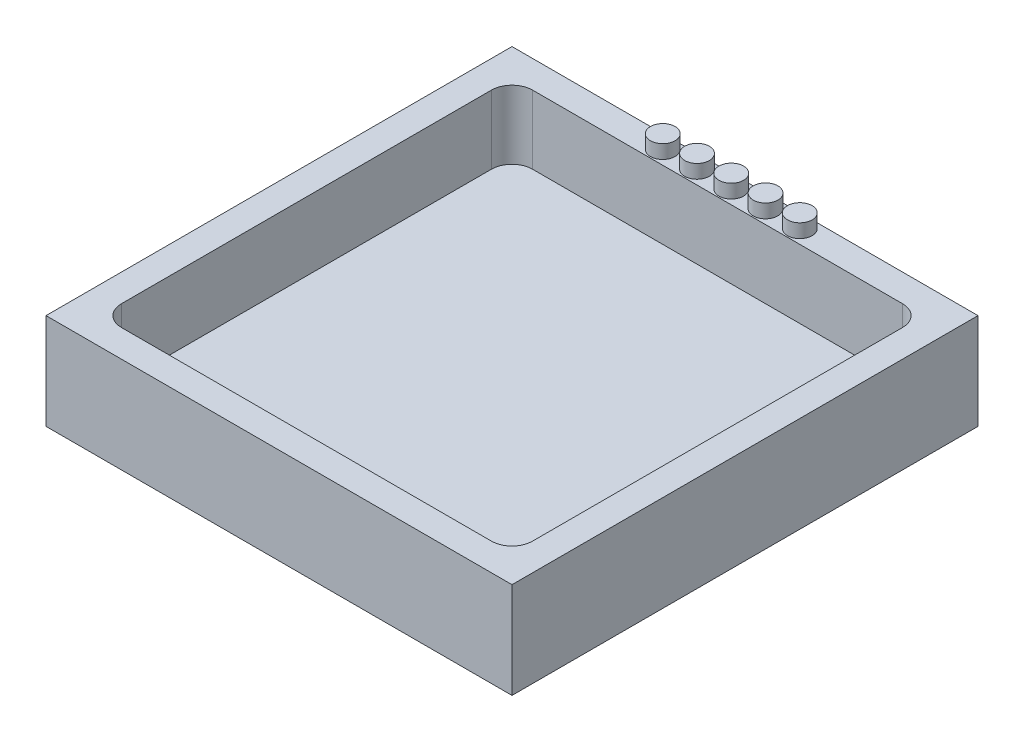
ISO-10303-21;
HEADER;
FILE_DESCRIPTION(('STEP AP214'),'2;1');
FILE_NAME('part.step','',(''),(''),'','','');
FILE_SCHEMA(('AUTOMOTIVE_DESIGN { 1 0 10303 214 1 1 1 1 }'));
ENDSEC;
DATA;
#1=APPLICATION_CONTEXT('core data for automotive mechanical design processes');
#2=APPLICATION_PROTOCOL_DEFINITION('international standard','automotive_design',2000,#1);
#3=PRODUCT_CONTEXT('',#1,'mechanical');
#4=PRODUCT('Part','Part','',(#3));
#5=PRODUCT_RELATED_PRODUCT_CATEGORY('part','',(#4));
#6=PRODUCT_DEFINITION_FORMATION('','',#4);
#7=PRODUCT_DEFINITION_CONTEXT('part definition',#1,'design');
#8=PRODUCT_DEFINITION('design','',#6,#7);
#9=PRODUCT_DEFINITION_SHAPE('','',#8);
#10=(LENGTH_UNIT() NAMED_UNIT(*) SI_UNIT(.MILLI.,.METRE.));
#11=(NAMED_UNIT(*) PLANE_ANGLE_UNIT() SI_UNIT($,.RADIAN.));
#12=(NAMED_UNIT(*) SI_UNIT($,.STERADIAN.) SOLID_ANGLE_UNIT());
#13=UNCERTAINTY_MEASURE_WITH_UNIT(LENGTH_MEASURE(1.E-05),#10,'distance_accuracy_value','');
#14=(GEOMETRIC_REPRESENTATION_CONTEXT(3) GLOBAL_UNCERTAINTY_ASSIGNED_CONTEXT((#13)) GLOBAL_UNIT_ASSIGNED_CONTEXT((#10,
#11,#12)) REPRESENTATION_CONTEXT('',''));
#15=CARTESIAN_POINT('',(0.,0.,0.));
#16=DIRECTION('',(0.,0.,1.));
#17=DIRECTION('',(1.,0.,0.));
#18=AXIS2_PLACEMENT_3D('',#15,#16,#17);
#19=CARTESIAN_POINT('',(0.,2.,0.));
#20=DIRECTION('',(0.,-1.,0.));
#21=DIRECTION('',(0.,0.,-1.));
#22=AXIS2_PLACEMENT_3D('',#19,#20,#21);
#23=PLANE('',#22);
#24=DIRECTION('',(1.,0.,0.));
#25=VECTOR('',#24,1.);
#26=CARTESIAN_POINT('',(-15.,2.,15.));
#27=LINE('',#26,#25);
#28=CARTESIAN_POINT('',(-13.5,2.,15.));
#29=VERTEX_POINT('',#28);
#30=CARTESIAN_POINT('',(13.5,2.,15.));
#31=VERTEX_POINT('',#30);
#32=EDGE_CURVE('E168',#29,#31,#27,.T.);
#33=ORIENTED_EDGE('',*,*,#32,.T.);
#34=CARTESIAN_POINT('',(13.5,2.,13.5));
#35=DIRECTION('',(0.,-1.,0.));
#36=DIRECTION('',(0.,0.,-1.));
#37=AXIS2_PLACEMENT_3D('',#34,#35,#36);
#38=CIRCLE('',#37,1.5);
#39=CARTESIAN_POINT('',(15.,2.,13.5));
#40=VERTEX_POINT('',#39);
#41=EDGE_CURVE('E182',#31,#40,#38,.F.);
#42=ORIENTED_EDGE('',*,*,#41,.T.);
#43=DIRECTION('',(0.,0.,-1.));
#44=VECTOR('',#43,1.);
#45=CARTESIAN_POINT('',(15.,2.,15.));
#46=LINE('',#45,#44);
#47=CARTESIAN_POINT('',(15.,2.,-13.5));
#48=VERTEX_POINT('',#47);
#49=EDGE_CURVE('E165',#40,#48,#46,.T.);
#50=ORIENTED_EDGE('',*,*,#49,.T.);
#51=CARTESIAN_POINT('',(13.5,2.,-13.5));
#52=DIRECTION('',(0.,-1.,0.));
#53=DIRECTION('',(0.,0.,-1.));
#54=AXIS2_PLACEMENT_3D('',#51,#52,#53);
#55=CIRCLE('',#54,1.5);
#56=CARTESIAN_POINT('',(13.5,2.,-15.));
#57=VERTEX_POINT('',#56);
#58=EDGE_CURVE('E176',#48,#57,#55,.F.);
#59=ORIENTED_EDGE('',*,*,#58,.T.);
#60=DIRECTION('',(1.,0.,0.));
#61=VECTOR('',#60,1.);
#62=CARTESIAN_POINT('',(-15.,2.,-15.));
#63=LINE('',#62,#61);
#64=CARTESIAN_POINT('',(-13.5,2.,-15.));
#65=VERTEX_POINT('',#64);
#66=EDGE_CURVE('E157',#65,#57,#63,.T.);
#67=ORIENTED_EDGE('',*,*,#66,.F.);
#68=CARTESIAN_POINT('',(-13.5,2.,-13.5));
#69=DIRECTION('',(0.,-1.,0.));
#70=DIRECTION('',(0.,0.,-1.));
#71=AXIS2_PLACEMENT_3D('',#68,#69,#70);
#72=CIRCLE('',#71,1.5);
#73=CARTESIAN_POINT('',(-15.,2.,-13.5));
#74=VERTEX_POINT('',#73);
#75=EDGE_CURVE('E180',#65,#74,#72,.F.);
#76=ORIENTED_EDGE('',*,*,#75,.T.);
#77=DIRECTION('',(0.,0.,-1.));
#78=VECTOR('',#77,1.);
#79=CARTESIAN_POINT('',(-15.,2.,15.));
#80=LINE('',#79,#78);
#81=CARTESIAN_POINT('',(-15.,2.,13.5));
#82=VERTEX_POINT('',#81);
#83=EDGE_CURVE('E155',#82,#74,#80,.T.);
#84=ORIENTED_EDGE('',*,*,#83,.F.);
#85=CARTESIAN_POINT('',(-13.5,2.,13.5));
#86=DIRECTION('',(0.,-1.,0.));
#87=DIRECTION('',(0.,0.,-1.));
#88=AXIS2_PLACEMENT_3D('',#85,#86,#87);
#89=CIRCLE('',#88,1.5);
#90=EDGE_CURVE('E178',#82,#29,#89,.F.);
#91=ORIENTED_EDGE('',*,*,#90,.T.);
#92=EDGE_LOOP('',(#33,#42,#50,#59,#67,#76,#84,#91));
#93=FACE_BOUND('',#92,.T.);
#94=ADVANCED_FACE('F39',(#93),#23,.F.);
#95=CARTESIAN_POINT('',(15.,7.,15.));
#96=DIRECTION('',(-1.,0.,0.));
#97=DIRECTION('',(0.,0.,1.));
#98=AXIS2_PLACEMENT_3D('',#95,#96,#97);
#99=PLANE('',#98);
#100=ORIENTED_EDGE('',*,*,#49,.F.);
#101=DIRECTION('',(0.,-1.,0.));
#102=VECTOR('',#101,1.);
#103=CARTESIAN_POINT('',(15.,7.,13.5));
#104=LINE('',#103,#102);
#105=CARTESIAN_POINT('',(15.,7.,13.5));
#106=VERTEX_POINT('',#105);
#107=EDGE_CURVE('E187',#40,#106,#104,.F.);
#108=ORIENTED_EDGE('',*,*,#107,.T.);
#109=DIRECTION('',(0.,0.,-1.));
#110=VECTOR('',#109,1.);
#111=CARTESIAN_POINT('',(15.,7.,15.));
#112=LINE('',#111,#110);
#113=CARTESIAN_POINT('',(15.,7.,-13.5));
#114=VERTEX_POINT('',#113);
#115=EDGE_CURVE('E289',#106,#114,#112,.T.);
#116=ORIENTED_EDGE('',*,*,#115,.T.);
#117=DIRECTION('',(0.,-1.,0.));
#118=VECTOR('',#117,1.);
#119=CARTESIAN_POINT('',(15.,2.,-13.5));
#120=LINE('',#119,#118);
#121=EDGE_CURVE('E184',#114,#48,#120,.T.);
#122=ORIENTED_EDGE('',*,*,#121,.T.);
#123=EDGE_LOOP('',(#100,#108,#116,#122));
#124=FACE_BOUND('',#123,.T.);
#125=ADVANCED_FACE('F246',(#124),#99,.T.);
#126=CARTESIAN_POINT('',(-15.,7.,-15.));
#127=DIRECTION('',(0.,0.,1.));
#128=DIRECTION('',(1.,0.,0.));
#129=AXIS2_PLACEMENT_3D('',#126,#127,#128);
#130=PLANE('',#129);
#131=DIRECTION('',(-1.,0.,0.));
#132=VECTOR('',#131,1.);
#133=CARTESIAN_POINT('',(-15.,7.,-15.));
#134=LINE('',#133,#132);
#135=CARTESIAN_POINT('',(13.5,7.,-15.));
#136=VERTEX_POINT('',#135);
#137=CARTESIAN_POINT('',(-13.5,7.,-15.));
#138=VERTEX_POINT('',#137);
#139=EDGE_CURVE('E287',#136,#138,#134,.T.);
#140=ORIENTED_EDGE('',*,*,#139,.T.);
#141=DIRECTION('',(0.,-1.,0.));
#142=VECTOR('',#141,1.);
#143=CARTESIAN_POINT('',(-13.5,2.,-15.));
#144=LINE('',#143,#142);
#145=EDGE_CURVE('E191',#138,#65,#144,.T.);
#146=ORIENTED_EDGE('',*,*,#145,.T.);
#147=ORIENTED_EDGE('',*,*,#66,.T.);
#148=DIRECTION('',(0.,-1.,0.));
#149=VECTOR('',#148,1.);
#150=CARTESIAN_POINT('',(13.5,7.,-15.));
#151=LINE('',#150,#149);
#152=EDGE_CURVE('E189',#57,#136,#151,.F.);
#153=ORIENTED_EDGE('',*,*,#152,.T.);
#154=EDGE_LOOP('',(#140,#146,#147,#153));
#155=FACE_BOUND('',#154,.T.);
#156=ADVANCED_FACE('F253',(#155),#130,.T.);
#157=CARTESIAN_POINT('',(-15.,7.,15.));
#158=DIRECTION('',(1.,0.,0.));
#159=DIRECTION('',(0.,0.,-1.));
#160=AXIS2_PLACEMENT_3D('',#157,#158,#159);
#161=PLANE('',#160);
#162=ORIENTED_EDGE('',*,*,#83,.T.);
#163=DIRECTION('',(0.,-1.,0.));
#164=VECTOR('',#163,1.);
#165=CARTESIAN_POINT('',(-15.,7.,-13.5));
#166=LINE('',#165,#164);
#167=CARTESIAN_POINT('',(-15.,7.,-13.5));
#168=VERTEX_POINT('',#167);
#169=EDGE_CURVE('E61',#74,#168,#166,.F.);
#170=ORIENTED_EDGE('',*,*,#169,.T.);
#171=DIRECTION('',(0.,0.,1.));
#172=VECTOR('',#171,1.);
#173=CARTESIAN_POINT('',(-15.,7.,15.));
#174=LINE('',#173,#172);
#175=CARTESIAN_POINT('',(-15.,7.,13.5));
#176=VERTEX_POINT('',#175);
#177=EDGE_CURVE('E278',#168,#176,#174,.T.);
#178=ORIENTED_EDGE('',*,*,#177,.T.);
#179=DIRECTION('',(0.,-1.,0.));
#180=VECTOR('',#179,1.);
#181=CARTESIAN_POINT('',(-15.,2.,13.5));
#182=LINE('',#181,#180);
#183=EDGE_CURVE('E194',#176,#82,#182,.T.);
#184=ORIENTED_EDGE('',*,*,#183,.T.);
#185=EDGE_LOOP('',(#162,#170,#178,#184));
#186=FACE_BOUND('',#185,.T.);
#187=ADVANCED_FACE('F277',(#186),#161,.T.);
#188=CARTESIAN_POINT('',(-15.,7.,15.));
#189=DIRECTION('',(0.,0.,-1.));
#190=DIRECTION('',(-1.,0.,0.));
#191=AXIS2_PLACEMENT_3D('',#188,#189,#190);
#192=PLANE('',#191);
#193=DIRECTION('',(1.,0.,0.));
#194=VECTOR('',#193,1.);
#195=CARTESIAN_POINT('',(-15.,7.,15.));
#196=LINE('',#195,#194);
#197=CARTESIAN_POINT('',(-13.5,7.,15.));
#198=VERTEX_POINT('',#197);
#199=CARTESIAN_POINT('',(13.5,7.,15.));
#200=VERTEX_POINT('',#199);
#201=EDGE_CURVE('E291',#198,#200,#196,.T.);
#202=ORIENTED_EDGE('',*,*,#201,.T.);
#203=DIRECTION('',(0.,-1.,0.));
#204=VECTOR('',#203,1.);
#205=CARTESIAN_POINT('',(13.5,2.,15.));
#206=LINE('',#205,#204);
#207=EDGE_CURVE('E173',#200,#31,#206,.T.);
#208=ORIENTED_EDGE('',*,*,#207,.T.);
#209=ORIENTED_EDGE('',*,*,#32,.F.);
#210=DIRECTION('',(0.,-1.,0.));
#211=VECTOR('',#210,1.);
#212=CARTESIAN_POINT('',(-13.5,7.,15.));
#213=LINE('',#212,#211);
#214=EDGE_CURVE('E171',#29,#198,#213,.F.);
#215=ORIENTED_EDGE('',*,*,#214,.T.);
#216=EDGE_LOOP('',(#202,#208,#209,#215));
#217=FACE_BOUND('',#216,.T.);
#218=ADVANCED_FACE('F220',(#217),#192,.T.);
#219=CARTESIAN_POINT('',(0.,7.,0.));
#220=DIRECTION('',(0.,-1.,0.));
#221=DIRECTION('',(0.,0.,-1.));
#222=AXIS2_PLACEMENT_3D('',#219,#220,#221);
#223=PLANE('',#222);
#224=CARTESIAN_POINT('',(5.,7.,-16.));
#225=DIRECTION('',(0.,-1.,0.));
#226=DIRECTION('',(0.,0.,-1.));
#227=AXIS2_PLACEMENT_3D('',#224,#225,#226);
#228=CIRCLE('',#227,0.9);
#229=CARTESIAN_POINT('',(5.,7.,-16.9));
#230=VERTEX_POINT('',#229);
#231=EDGE_CURVE('E11',#230,#230,#228,.F.);
#232=ORIENTED_EDGE('',*,*,#231,.F.);
#233=EDGE_LOOP('',(#232));
#234=FACE_BOUND('',#233,.T.);
#235=CARTESIAN_POINT('',(2.5,7.,-16.));
#236=DIRECTION('',(0.,-1.,0.));
#237=DIRECTION('',(0.,0.,-1.));
#238=AXIS2_PLACEMENT_3D('',#235,#236,#237);
#239=CIRCLE('',#238,0.9);
#240=CARTESIAN_POINT('',(2.5,7.,-16.9));
#241=VERTEX_POINT('',#240);
#242=EDGE_CURVE('E47',#241,#241,#239,.F.);
#243=ORIENTED_EDGE('',*,*,#242,.F.);
#244=EDGE_LOOP('',(#243));
#245=FACE_BOUND('',#244,.T.);
#246=CARTESIAN_POINT('',(-5.,7.,-16.));
#247=DIRECTION('',(0.,-1.,0.));
#248=DIRECTION('',(0.,0.,-1.));
#249=AXIS2_PLACEMENT_3D('',#246,#247,#248);
#250=CIRCLE('',#249,0.9);
#251=CARTESIAN_POINT('',(-5.,7.,-16.9));
#252=VERTEX_POINT('',#251);
#253=EDGE_CURVE('E211',#252,#252,#250,.F.);
#254=ORIENTED_EDGE('',*,*,#253,.F.);
#255=EDGE_LOOP('',(#254));
#256=FACE_BOUND('',#255,.T.);
#257=CARTESIAN_POINT('',(-2.5,7.,-16.));
#258=DIRECTION('',(0.,-1.,0.));
#259=DIRECTION('',(0.,0.,-1.));
#260=AXIS2_PLACEMENT_3D('',#257,#258,#259);
#261=CIRCLE('',#260,0.900000000000001);
#262=CARTESIAN_POINT('',(-2.5,7.,-16.9));
#263=VERTEX_POINT('',#262);
#264=EDGE_CURVE('E208',#263,#263,#261,.F.);
#265=ORIENTED_EDGE('',*,*,#264,.F.);
#266=EDGE_LOOP('',(#265));
#267=FACE_BOUND('',#266,.T.);
#268=CARTESIAN_POINT('',(0.,7.,-16.));
#269=DIRECTION('',(0.,-1.,0.));
#270=DIRECTION('',(0.,0.,-1.));
#271=AXIS2_PLACEMENT_3D('',#268,#269,#270);
#272=CIRCLE('',#271,0.900000000000001);
#273=CARTESIAN_POINT('',(0.,7.,-16.9));
#274=VERTEX_POINT('',#273);
#275=EDGE_CURVE('E205',#274,#274,#272,.F.);
#276=ORIENTED_EDGE('',*,*,#275,.F.);
#277=EDGE_LOOP('',(#276));
#278=FACE_BOUND('',#277,.T.);
#279=DIRECTION('',(0.,0.,-1.));
#280=VECTOR('',#279,1.);
#281=CARTESIAN_POINT('',(17.,7.,17.));
#282=LINE('',#281,#280);
#283=CARTESIAN_POINT('',(17.,7.,17.));
#284=VERTEX_POINT('',#283);
#285=CARTESIAN_POINT('',(17.,7.,-17.));
#286=VERTEX_POINT('',#285);
#287=EDGE_CURVE('E141',#284,#286,#282,.T.);
#288=ORIENTED_EDGE('',*,*,#287,.T.);
#289=DIRECTION('',(-1.,0.,0.));
#290=VECTOR('',#289,1.);
#291=CARTESIAN_POINT('',(-17.,7.,-17.));
#292=LINE('',#291,#290);
#293=CARTESIAN_POINT('',(-17.,7.,-17.));
#294=VERTEX_POINT('',#293);
#295=EDGE_CURVE('E130',#286,#294,#292,.T.);
#296=ORIENTED_EDGE('',*,*,#295,.T.);
#297=DIRECTION('',(0.,0.,1.));
#298=VECTOR('',#297,1.);
#299=CARTESIAN_POINT('',(-17.,7.,17.));
#300=LINE('',#299,#298);
#301=CARTESIAN_POINT('',(-17.,7.,17.));
#302=VERTEX_POINT('',#301);
#303=EDGE_CURVE('E140',#294,#302,#300,.T.);
#304=ORIENTED_EDGE('',*,*,#303,.T.);
#305=DIRECTION('',(1.,0.,0.));
#306=VECTOR('',#305,1.);
#307=CARTESIAN_POINT('',(-17.,7.,17.));
#308=LINE('',#307,#306);
#309=EDGE_CURVE('E146',#302,#284,#308,.T.);
#310=ORIENTED_EDGE('',*,*,#309,.T.);
#311=EDGE_LOOP('',(#288,#296,#304,#310));
#312=FACE_BOUND('',#311,.T.);
#313=ORIENTED_EDGE('',*,*,#115,.F.);
#314=CARTESIAN_POINT('',(13.5,7.,13.5));
#315=DIRECTION('',(0.,-1.,0.));
#316=DIRECTION('',(0.,0.,-1.));
#317=AXIS2_PLACEMENT_3D('',#314,#315,#316);
#318=CIRCLE('',#317,1.5);
#319=EDGE_CURVE('E198',#106,#200,#318,.T.);
#320=ORIENTED_EDGE('',*,*,#319,.T.);
#321=ORIENTED_EDGE('',*,*,#201,.F.);
#322=CARTESIAN_POINT('',(-13.5,7.,13.5));
#323=DIRECTION('',(0.,-1.,0.));
#324=DIRECTION('',(0.,0.,-1.));
#325=AXIS2_PLACEMENT_3D('',#322,#323,#324);
#326=CIRCLE('',#325,1.5);
#327=EDGE_CURVE('E54',#198,#176,#326,.T.);
#328=ORIENTED_EDGE('',*,*,#327,.T.);
#329=ORIENTED_EDGE('',*,*,#177,.F.);
#330=CARTESIAN_POINT('',(-13.5,7.,-13.5));
#331=DIRECTION('',(0.,-1.,0.));
#332=DIRECTION('',(0.,0.,-1.));
#333=AXIS2_PLACEMENT_3D('',#330,#331,#332);
#334=CIRCLE('',#333,1.5);
#335=EDGE_CURVE('E200',#168,#138,#334,.T.);
#336=ORIENTED_EDGE('',*,*,#335,.T.);
#337=ORIENTED_EDGE('',*,*,#139,.F.);
#338=CARTESIAN_POINT('',(13.5,7.,-13.5));
#339=DIRECTION('',(0.,-1.,0.));
#340=DIRECTION('',(0.,0.,-1.));
#341=AXIS2_PLACEMENT_3D('',#338,#339,#340);
#342=CIRCLE('',#341,1.5);
#343=EDGE_CURVE('E203',#136,#114,#342,.T.);
#344=ORIENTED_EDGE('',*,*,#343,.T.);
#345=EDGE_LOOP('',(#313,#320,#321,#328,#329,#336,#337,#344));
#346=FACE_BOUND('',#345,.T.);
#347=ADVANCED_FACE('F144',(#234,#245,#256,#267,#278,#312,#346),#223,.F.);
#348=CARTESIAN_POINT('',(17.,7.,17.));
#349=DIRECTION('',(-1.,0.,0.));
#350=DIRECTION('',(0.,0.,1.));
#351=AXIS2_PLACEMENT_3D('',#348,#349,#350);
#352=PLANE('',#351);
#353=DIRECTION('',(0.,0.,-1.));
#354=VECTOR('',#353,1.);
#355=CARTESIAN_POINT('',(17.,0.,17.));
#356=LINE('',#355,#354);
#357=CARTESIAN_POINT('',(17.,0.,17.));
#358=VERTEX_POINT('',#357);
#359=CARTESIAN_POINT('',(17.,0.,-17.));
#360=VERTEX_POINT('',#359);
#361=EDGE_CURVE('E154',#358,#360,#356,.T.);
#362=ORIENTED_EDGE('',*,*,#361,.T.);
#363=DIRECTION('',(0.,-1.,0.));
#364=VECTOR('',#363,1.);
#365=CARTESIAN_POINT('',(17.,7.,-17.));
#366=LINE('',#365,#364);
#367=EDGE_CURVE('E134',#286,#360,#366,.T.);
#368=ORIENTED_EDGE('',*,*,#367,.F.);
#369=ORIENTED_EDGE('',*,*,#287,.F.);
#370=DIRECTION('',(0.,-1.,0.));
#371=VECTOR('',#370,1.);
#372=CARTESIAN_POINT('',(17.,7.,17.));
#373=LINE('',#372,#371);
#374=EDGE_CURVE('E302',#284,#358,#373,.T.);
#375=ORIENTED_EDGE('',*,*,#374,.T.);
#376=EDGE_LOOP('',(#362,#368,#369,#375));
#377=FACE_BOUND('',#376,.T.);
#378=ADVANCED_FACE('F152',(#377),#352,.F.);
#379=CARTESIAN_POINT('',(-17.,7.,-17.));
#380=DIRECTION('',(0.,0.,1.));
#381=DIRECTION('',(1.,0.,0.));
#382=AXIS2_PLACEMENT_3D('',#379,#380,#381);
#383=PLANE('',#382);
#384=DIRECTION('',(-1.,0.,0.));
#385=VECTOR('',#384,1.);
#386=CARTESIAN_POINT('',(-17.,0.,-17.));
#387=LINE('',#386,#385);
#388=CARTESIAN_POINT('',(-17.,0.,-17.));
#389=VERTEX_POINT('',#388);
#390=EDGE_CURVE('E304',#360,#389,#387,.T.);
#391=ORIENTED_EDGE('',*,*,#390,.T.);
#392=DIRECTION('',(0.,-1.,0.));
#393=VECTOR('',#392,1.);
#394=CARTESIAN_POINT('',(-17.,7.,-17.));
#395=LINE('',#394,#393);
#396=EDGE_CURVE('E137',#294,#389,#395,.T.);
#397=ORIENTED_EDGE('',*,*,#396,.F.);
#398=ORIENTED_EDGE('',*,*,#295,.F.);
#399=ORIENTED_EDGE('',*,*,#367,.T.);
#400=EDGE_LOOP('',(#391,#397,#398,#399));
#401=FACE_BOUND('',#400,.T.);
#402=ADVANCED_FACE('F132',(#401),#383,.F.);
#403=CARTESIAN_POINT('',(-17.,7.,17.));
#404=DIRECTION('',(1.,0.,0.));
#405=DIRECTION('',(0.,0.,-1.));
#406=AXIS2_PLACEMENT_3D('',#403,#404,#405);
#407=PLANE('',#406);
#408=DIRECTION('',(0.,0.,1.));
#409=VECTOR('',#408,1.);
#410=CARTESIAN_POINT('',(-17.,0.,17.));
#411=LINE('',#410,#409);
#412=CARTESIAN_POINT('',(-17.,0.,17.));
#413=VERTEX_POINT('',#412);
#414=EDGE_CURVE('E306',#389,#413,#411,.T.);
#415=ORIENTED_EDGE('',*,*,#414,.T.);
#416=DIRECTION('',(0.,-1.,0.));
#417=VECTOR('',#416,1.);
#418=CARTESIAN_POINT('',(-17.,7.,17.));
#419=LINE('',#418,#417);
#420=EDGE_CURVE('E159',#302,#413,#419,.T.);
#421=ORIENTED_EDGE('',*,*,#420,.F.);
#422=ORIENTED_EDGE('',*,*,#303,.F.);
#423=ORIENTED_EDGE('',*,*,#396,.T.);
#424=EDGE_LOOP('',(#415,#421,#422,#423));
#425=FACE_BOUND('',#424,.T.);
#426=ADVANCED_FACE('F315',(#425),#407,.F.);
#427=CARTESIAN_POINT('',(-17.,7.,17.));
#428=DIRECTION('',(0.,0.,-1.));
#429=DIRECTION('',(-1.,0.,0.));
#430=AXIS2_PLACEMENT_3D('',#427,#428,#429);
#431=PLANE('',#430);
#432=DIRECTION('',(1.,0.,0.));
#433=VECTOR('',#432,1.);
#434=CARTESIAN_POINT('',(-17.,0.,17.));
#435=LINE('',#434,#433);
#436=EDGE_CURVE('E150',#413,#358,#435,.T.);
#437=ORIENTED_EDGE('',*,*,#436,.T.);
#438=ORIENTED_EDGE('',*,*,#374,.F.);
#439=ORIENTED_EDGE('',*,*,#309,.F.);
#440=ORIENTED_EDGE('',*,*,#420,.T.);
#441=EDGE_LOOP('',(#437,#438,#439,#440));
#442=FACE_BOUND('',#441,.T.);
#443=ADVANCED_FACE('F262',(#442),#431,.F.);
#444=CARTESIAN_POINT('',(0.,0.,0.));
#445=DIRECTION('',(0.,-1.,0.));
#446=DIRECTION('',(0.,0.,-1.));
#447=AXIS2_PLACEMENT_3D('',#444,#445,#446);
#448=PLANE('',#447);
#449=ORIENTED_EDGE('',*,*,#361,.F.);
#450=ORIENTED_EDGE('',*,*,#436,.F.);
#451=ORIENTED_EDGE('',*,*,#414,.F.);
#452=ORIENTED_EDGE('',*,*,#390,.F.);
#453=EDGE_LOOP('',(#449,#450,#451,#452));
#454=FACE_BOUND('',#453,.T.);
#455=ADVANCED_FACE('F259',(#454),#448,.T.);
#456=CARTESIAN_POINT('',(13.5,7.,13.5));
#457=DIRECTION('',(0.,1.,0.));
#458=DIRECTION('',(0.,0.,1.));
#459=AXIS2_PLACEMENT_3D('',#456,#457,#458);
#460=CYLINDRICAL_SURFACE('',#459,1.5);
#461=ORIENTED_EDGE('',*,*,#319,.F.);
#462=ORIENTED_EDGE('',*,*,#107,.F.);
#463=ORIENTED_EDGE('',*,*,#41,.F.);
#464=ORIENTED_EDGE('',*,*,#207,.F.);
#465=EDGE_LOOP('',(#461,#462,#463,#464));
#466=FACE_BOUND('',#465,.T.);
#467=ADVANCED_FACE('F261',(#466),#460,.F.);
#468=CARTESIAN_POINT('',(-13.5,7.,-13.5));
#469=DIRECTION('',(0.,1.,0.));
#470=DIRECTION('',(0.,0.,1.));
#471=AXIS2_PLACEMENT_3D('',#468,#469,#470);
#472=CYLINDRICAL_SURFACE('',#471,1.5);
#473=ORIENTED_EDGE('',*,*,#335,.F.);
#474=ORIENTED_EDGE('',*,*,#169,.F.);
#475=ORIENTED_EDGE('',*,*,#75,.F.);
#476=ORIENTED_EDGE('',*,*,#145,.F.);
#477=EDGE_LOOP('',(#473,#474,#475,#476));
#478=FACE_BOUND('',#477,.T.);
#479=ADVANCED_FACE('F266',(#478),#472,.F.);
#480=CARTESIAN_POINT('',(-13.5,7.,13.5));
#481=DIRECTION('',(0.,1.,0.));
#482=DIRECTION('',(0.,0.,1.));
#483=AXIS2_PLACEMENT_3D('',#480,#481,#482);
#484=CYLINDRICAL_SURFACE('',#483,1.5);
#485=ORIENTED_EDGE('',*,*,#327,.F.);
#486=ORIENTED_EDGE('',*,*,#214,.F.);
#487=ORIENTED_EDGE('',*,*,#90,.F.);
#488=ORIENTED_EDGE('',*,*,#183,.F.);
#489=EDGE_LOOP('',(#485,#486,#487,#488));
#490=FACE_BOUND('',#489,.T.);
#491=ADVANCED_FACE('F241',(#490),#484,.F.);
#492=CARTESIAN_POINT('',(13.5,7.,-13.5));
#493=DIRECTION('',(0.,1.,0.));
#494=DIRECTION('',(0.,0.,1.));
#495=AXIS2_PLACEMENT_3D('',#492,#493,#494);
#496=CYLINDRICAL_SURFACE('',#495,1.5);
#497=ORIENTED_EDGE('',*,*,#343,.F.);
#498=ORIENTED_EDGE('',*,*,#152,.F.);
#499=ORIENTED_EDGE('',*,*,#58,.F.);
#500=ORIENTED_EDGE('',*,*,#121,.F.);
#501=EDGE_LOOP('',(#497,#498,#499,#500));
#502=FACE_BOUND('',#501,.T.);
#503=ADVANCED_FACE('F41',(#502),#496,.F.);
#504=CARTESIAN_POINT('',(0.,8.,-16.));
#505=DIRECTION('',(0.,-1.,0.));
#506=DIRECTION('',(0.,0.,-1.));
#507=AXIS2_PLACEMENT_3D('',#504,#505,#506);
#508=CYLINDRICAL_SURFACE('',#507,0.900000000000001);
#509=CARTESIAN_POINT('',(0.,8.,-16.));
#510=DIRECTION('',(0.,1.,0.));
#511=DIRECTION('',(0.,0.,1.));
#512=AXIS2_PLACEMENT_3D('',#509,#510,#511);
#513=CIRCLE('',#512,0.900000000000001);
#514=CARTESIAN_POINT('',(0.,8.,-15.1));
#515=VERTEX_POINT('',#514);
#516=EDGE_CURVE('E294',#515,#515,#513,.T.);
#517=ORIENTED_EDGE('',*,*,#516,.F.);
#518=EDGE_LOOP('',(#517));
#519=FACE_BOUND('',#518,.T.);
#520=ORIENTED_EDGE('',*,*,#275,.T.);
#521=EDGE_LOOP('',(#520));
#522=FACE_BOUND('',#521,.T.);
#523=ADVANCED_FACE('F229',(#519,#522),#508,.T.);
#524=CARTESIAN_POINT('',(0.,8.,-16.));
#525=DIRECTION('',(0.,1.,0.));
#526=DIRECTION('',(0.,0.,1.));
#527=AXIS2_PLACEMENT_3D('',#524,#525,#526);
#528=PLANE('',#527);
#529=ORIENTED_EDGE('',*,*,#516,.T.);
#530=EDGE_LOOP('',(#529));
#531=FACE_BOUND('',#530,.T.);
#532=ADVANCED_FACE('F231',(#531),#528,.T.);
#533=CARTESIAN_POINT('',(-2.5,8.,-16.));
#534=DIRECTION('',(0.,-1.,0.));
#535=DIRECTION('',(0.,0.,-1.));
#536=AXIS2_PLACEMENT_3D('',#533,#534,#535);
#537=CYLINDRICAL_SURFACE('',#536,0.900000000000001);
#538=CARTESIAN_POINT('',(-2.5,8.,-16.));
#539=DIRECTION('',(0.,1.,0.));
#540=DIRECTION('',(0.,0.,1.));
#541=AXIS2_PLACEMENT_3D('',#538,#539,#540);
#542=CIRCLE('',#541,0.900000000000001);
#543=CARTESIAN_POINT('',(-2.5,8.,-15.1));
#544=VERTEX_POINT('',#543);
#545=EDGE_CURVE('E464',#544,#544,#542,.T.);
#546=ORIENTED_EDGE('',*,*,#545,.F.);
#547=EDGE_LOOP('',(#546));
#548=FACE_BOUND('',#547,.T.);
#549=ORIENTED_EDGE('',*,*,#264,.T.);
#550=EDGE_LOOP('',(#549));
#551=FACE_BOUND('',#550,.T.);
#552=ADVANCED_FACE('F237',(#548,#551),#537,.T.);
#553=CARTESIAN_POINT('',(-2.5,8.,-16.));
#554=DIRECTION('',(0.,1.,0.));
#555=DIRECTION('',(0.,0.,1.));
#556=AXIS2_PLACEMENT_3D('',#553,#554,#555);
#557=PLANE('',#556);
#558=ORIENTED_EDGE('',*,*,#545,.T.);
#559=EDGE_LOOP('',(#558));
#560=FACE_BOUND('',#559,.T.);
#561=ADVANCED_FACE('F381',(#560),#557,.T.);
#562=CARTESIAN_POINT('',(-5.,8.,-16.));
#563=DIRECTION('',(0.,-1.,0.));
#564=DIRECTION('',(0.,0.,-1.));
#565=AXIS2_PLACEMENT_3D('',#562,#563,#564);
#566=CYLINDRICAL_SURFACE('',#565,0.9);
#567=CARTESIAN_POINT('',(-5.,8.,-16.));
#568=DIRECTION('',(0.,1.,0.));
#569=DIRECTION('',(0.,0.,1.));
#570=AXIS2_PLACEMENT_3D('',#567,#568,#569);
#571=CIRCLE('',#570,0.9);
#572=CARTESIAN_POINT('',(-5.,8.,-15.1));
#573=VERTEX_POINT('',#572);
#574=EDGE_CURVE('E459',#573,#573,#571,.T.);
#575=ORIENTED_EDGE('',*,*,#574,.F.);
#576=EDGE_LOOP('',(#575));
#577=FACE_BOUND('',#576,.T.);
#578=ORIENTED_EDGE('',*,*,#253,.T.);
#579=EDGE_LOOP('',(#578));
#580=FACE_BOUND('',#579,.T.);
#581=ADVANCED_FACE('F391',(#577,#580),#566,.T.);
#582=CARTESIAN_POINT('',(-5.,8.,-16.));
#583=DIRECTION('',(0.,1.,0.));
#584=DIRECTION('',(0.,0.,1.));
#585=AXIS2_PLACEMENT_3D('',#582,#583,#584);
#586=PLANE('',#585);
#587=ORIENTED_EDGE('',*,*,#574,.T.);
#588=EDGE_LOOP('',(#587));
#589=FACE_BOUND('',#588,.T.);
#590=ADVANCED_FACE('F401',(#589),#586,.T.);
#591=CARTESIAN_POINT('',(2.5,8.,-16.));
#592=DIRECTION('',(0.,-1.,0.));
#593=DIRECTION('',(0.,0.,-1.));
#594=AXIS2_PLACEMENT_3D('',#591,#592,#593);
#595=CYLINDRICAL_SURFACE('',#594,0.9);
#596=CARTESIAN_POINT('',(2.5,8.,-16.));
#597=DIRECTION('',(0.,1.,0.));
#598=DIRECTION('',(0.,0.,1.));
#599=AXIS2_PLACEMENT_3D('',#596,#597,#598);
#600=CIRCLE('',#599,0.9);
#601=CARTESIAN_POINT('',(2.5,8.,-15.1));
#602=VERTEX_POINT('',#601);
#603=EDGE_CURVE('E456',#602,#602,#600,.T.);
#604=ORIENTED_EDGE('',*,*,#603,.F.);
#605=EDGE_LOOP('',(#604));
#606=FACE_BOUND('',#605,.T.);
#607=ORIENTED_EDGE('',*,*,#242,.T.);
#608=EDGE_LOOP('',(#607));
#609=FACE_BOUND('',#608,.T.);
#610=ADVANCED_FACE('F216',(#606,#609),#595,.T.);
#611=CARTESIAN_POINT('',(2.5,8.,-16.));
#612=DIRECTION('',(0.,1.,0.));
#613=DIRECTION('',(0.,0.,1.));
#614=AXIS2_PLACEMENT_3D('',#611,#612,#613);
#615=PLANE('',#614);
#616=ORIENTED_EDGE('',*,*,#603,.T.);
#617=EDGE_LOOP('',(#616));
#618=FACE_BOUND('',#617,.T.);
#619=ADVANCED_FACE('F420',(#618),#615,.T.);
#620=CARTESIAN_POINT('',(5.,8.,-16.));
#621=DIRECTION('',(0.,-1.,0.));
#622=DIRECTION('',(0.,0.,-1.));
#623=AXIS2_PLACEMENT_3D('',#620,#621,#622);
#624=CYLINDRICAL_SURFACE('',#623,0.9);
#625=CARTESIAN_POINT('',(5.,8.,-16.));
#626=DIRECTION('',(0.,1.,0.));
#627=DIRECTION('',(0.,0.,1.));
#628=AXIS2_PLACEMENT_3D('',#625,#626,#627);
#629=CIRCLE('',#628,0.9);
#630=CARTESIAN_POINT('',(5.,8.,-15.1));
#631=VERTEX_POINT('',#630);
#632=EDGE_CURVE('E455',#631,#631,#629,.T.);
#633=ORIENTED_EDGE('',*,*,#632,.F.);
#634=EDGE_LOOP('',(#633));
#635=FACE_BOUND('',#634,.T.);
#636=ORIENTED_EDGE('',*,*,#231,.T.);
#637=EDGE_LOOP('',(#636));
#638=FACE_BOUND('',#637,.T.);
#639=ADVANCED_FACE('F430',(#635,#638),#624,.T.);
#640=CARTESIAN_POINT('',(5.,8.,-16.));
#641=DIRECTION('',(0.,1.,0.));
#642=DIRECTION('',(0.,0.,1.));
#643=AXIS2_PLACEMENT_3D('',#640,#641,#642);
#644=PLANE('',#643);
#645=ORIENTED_EDGE('',*,*,#632,.T.);
#646=EDGE_LOOP('',(#645));
#647=FACE_BOUND('',#646,.T.);
#648=ADVANCED_FACE('F440',(#647),#644,.T.);
#649=CLOSED_SHELL('',(#94,#125,#156,#187,#218,#347,#378,#402,#426,#443,#455,#467,#479,#491,#503,
#523,#532,#552,#561,#581,#590,#610,#619,#639,#648));
#650=MANIFOLD_SOLID_BREP('B2',#649);
#651=ADVANCED_BREP_SHAPE_REPRESENTATION('',(#18,#650),#14);
#652=SHAPE_DEFINITION_REPRESENTATION(#9,#651);
ENDSEC;
END-ISO-10303-21;
